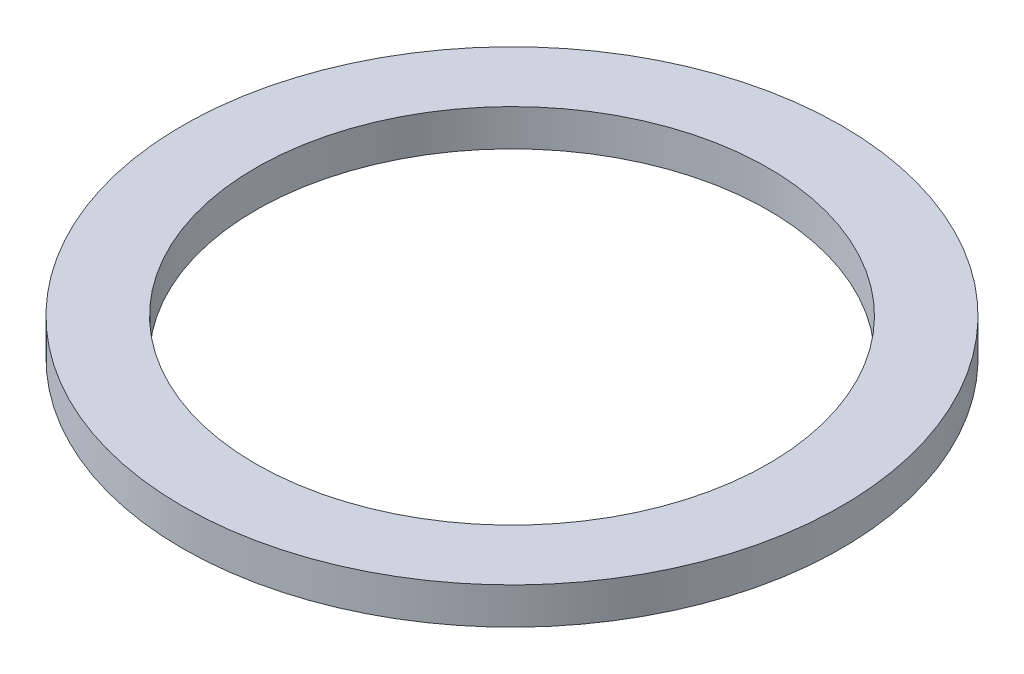
ISO-10303-21;
HEADER;
FILE_DESCRIPTION(('STEP AP214'),'2;1');
FILE_NAME('part.step','',(''),(''),'','','');
FILE_SCHEMA(('AUTOMOTIVE_DESIGN { 1 0 10303 214 1 1 1 1 }'));
ENDSEC;
DATA;
#1=APPLICATION_CONTEXT('core data for automotive mechanical design processes');
#2=APPLICATION_PROTOCOL_DEFINITION('international standard','automotive_design',2000,#1);
#3=PRODUCT_CONTEXT('',#1,'mechanical');
#4=PRODUCT('Part','Part','',(#3));
#5=PRODUCT_RELATED_PRODUCT_CATEGORY('part','',(#4));
#6=PRODUCT_DEFINITION_FORMATION('','',#4);
#7=PRODUCT_DEFINITION_CONTEXT('part definition',#1,'design');
#8=PRODUCT_DEFINITION('design','',#6,#7);
#9=PRODUCT_DEFINITION_SHAPE('','',#8);
#10=(LENGTH_UNIT() NAMED_UNIT(*) SI_UNIT(.MILLI.,.METRE.));
#11=(NAMED_UNIT(*) PLANE_ANGLE_UNIT() SI_UNIT($,.RADIAN.));
#12=(NAMED_UNIT(*) SI_UNIT($,.STERADIAN.) SOLID_ANGLE_UNIT());
#13=UNCERTAINTY_MEASURE_WITH_UNIT(LENGTH_MEASURE(1.E-05),#10,'distance_accuracy_value','');
#14=(GEOMETRIC_REPRESENTATION_CONTEXT(3) GLOBAL_UNCERTAINTY_ASSIGNED_CONTEXT((#13)) GLOBAL_UNIT_ASSIGNED_CONTEXT((#10,
#11,#12)) REPRESENTATION_CONTEXT('',''));
#15=CARTESIAN_POINT('',(0.,0.,0.));
#16=DIRECTION('',(0.,0.,1.));
#17=DIRECTION('',(1.,0.,0.));
#18=AXIS2_PLACEMENT_3D('',#15,#16,#17);
#19=CARTESIAN_POINT('',(0.,5.,0.));
#20=DIRECTION('',(0.,1.,0.));
#21=DIRECTION('',(0.,0.,1.));
#22=AXIS2_PLACEMENT_3D('',#19,#20,#21);
#23=PLANE('',#22);
#24=CARTESIAN_POINT('',(0.,5.,0.));
#25=DIRECTION('',(0.,1.,0.));
#26=DIRECTION('',(0.,0.,1.));
#27=AXIS2_PLACEMENT_3D('',#24,#25,#26);
#28=CIRCLE('',#27,45.);
#29=CARTESIAN_POINT('',(0.,5.,45.));
#30=VERTEX_POINT('',#29);
#31=EDGE_CURVE('E10',#30,#30,#28,.T.);
#32=ORIENTED_EDGE('',*,*,#31,.T.);
#33=EDGE_LOOP('',(#32));
#34=FACE_BOUND('',#33,.T.);
#35=CARTESIAN_POINT('',(0.,5.,0.));
#36=DIRECTION('',(0.,1.,0.));
#37=DIRECTION('',(0.,0.,1.));
#38=AXIS2_PLACEMENT_3D('',#35,#36,#37);
#39=CIRCLE('',#38,35.);
#40=CARTESIAN_POINT('',(0.,5.,35.));
#41=VERTEX_POINT('',#40);
#42=EDGE_CURVE('E42',#41,#41,#39,.T.);
#43=ORIENTED_EDGE('',*,*,#42,.F.);
#44=EDGE_LOOP('',(#43));
#45=FACE_BOUND('',#44,.T.);
#46=ADVANCED_FACE('F31',(#34,#45),#23,.T.);
#47=CARTESIAN_POINT('',(0.,0.,0.));
#48=DIRECTION('',(0.,1.,0.));
#49=DIRECTION('',(0.,0.,1.));
#50=AXIS2_PLACEMENT_3D('',#47,#48,#49);
#51=PLANE('',#50);
#52=CARTESIAN_POINT('',(0.,0.,0.));
#53=DIRECTION('',(0.,1.,0.));
#54=DIRECTION('',(0.,0.,1.));
#55=AXIS2_PLACEMENT_3D('',#52,#53,#54);
#56=CIRCLE('',#55,45.);
#57=CARTESIAN_POINT('',(0.,0.,45.));
#58=VERTEX_POINT('',#57);
#59=EDGE_CURVE('E35',#58,#58,#56,.T.);
#60=ORIENTED_EDGE('',*,*,#59,.F.);
#61=EDGE_LOOP('',(#60));
#62=FACE_BOUND('',#61,.T.);
#63=CARTESIAN_POINT('',(0.,0.,0.));
#64=DIRECTION('',(0.,1.,0.));
#65=DIRECTION('',(0.,0.,1.));
#66=AXIS2_PLACEMENT_3D('',#63,#64,#65);
#67=CIRCLE('',#66,35.);
#68=CARTESIAN_POINT('',(0.,0.,35.));
#69=VERTEX_POINT('',#68);
#70=EDGE_CURVE('E44',#69,#69,#67,.T.);
#71=ORIENTED_EDGE('',*,*,#70,.T.);
#72=EDGE_LOOP('',(#71));
#73=FACE_BOUND('',#72,.T.);
#74=ADVANCED_FACE('F54',(#62,#73),#51,.F.);
#75=CARTESIAN_POINT('',(0.,5.,0.));
#76=DIRECTION('',(0.,-1.,0.));
#77=DIRECTION('',(0.,0.,-1.));
#78=AXIS2_PLACEMENT_3D('',#75,#76,#77);
#79=CYLINDRICAL_SURFACE('',#78,45.);
#80=ORIENTED_EDGE('',*,*,#31,.F.);
#81=EDGE_LOOP('',(#80));
#82=FACE_BOUND('',#81,.T.);
#83=ORIENTED_EDGE('',*,*,#59,.T.);
#84=EDGE_LOOP('',(#83));
#85=FACE_BOUND('',#84,.T.);
#86=ADVANCED_FACE('F33',(#82,#85),#79,.T.);
#87=CARTESIAN_POINT('',(0.,5.,0.));
#88=DIRECTION('',(0.,-1.,0.));
#89=DIRECTION('',(0.,0.,-1.));
#90=AXIS2_PLACEMENT_3D('',#87,#88,#89);
#91=CYLINDRICAL_SURFACE('',#90,35.);
#92=ORIENTED_EDGE('',*,*,#42,.T.);
#93=EDGE_LOOP('',(#92));
#94=FACE_BOUND('',#93,.T.);
#95=ORIENTED_EDGE('',*,*,#70,.F.);
#96=EDGE_LOOP('',(#95));
#97=FACE_BOUND('',#96,.T.);
#98=ADVANCED_FACE('F50',(#94,#97),#91,.F.);
#99=CLOSED_SHELL('',(#46,#74,#86,#98));
#100=MANIFOLD_SOLID_BREP('B2',#99);
#101=ADVANCED_BREP_SHAPE_REPRESENTATION('',(#18,#100),#14);
#102=SHAPE_DEFINITION_REPRESENTATION(#9,#101);
ENDSEC;
END-ISO-10303-21;
